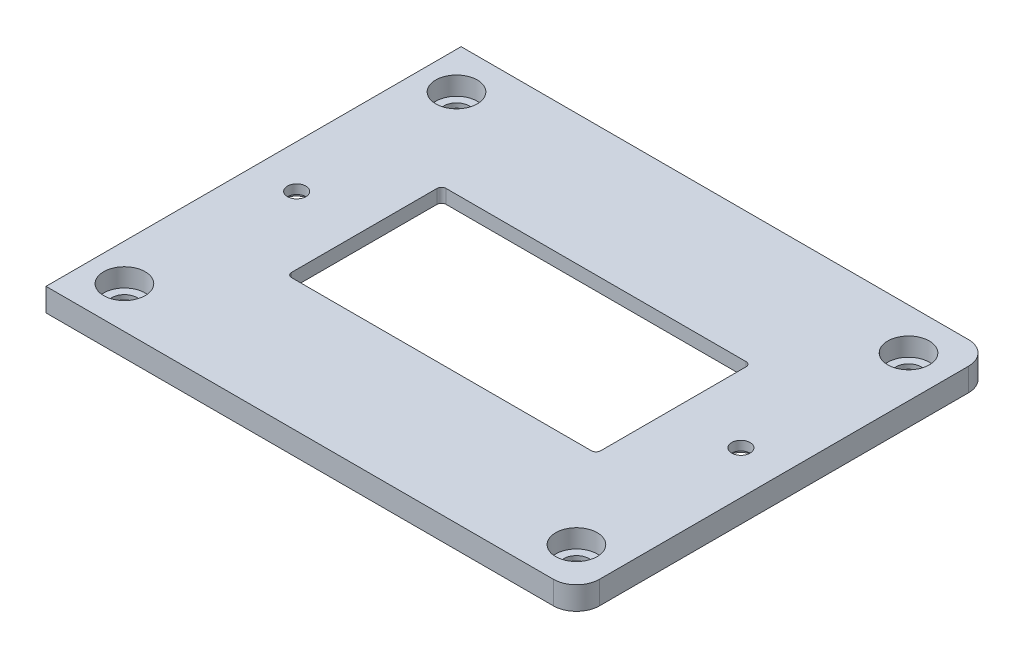
ISO-10303-21;
HEADER;
FILE_DESCRIPTION(('STEP AP214'),'2;1');
FILE_NAME('part.step','',(''),(''),'','','');
FILE_SCHEMA(('AUTOMOTIVE_DESIGN { 1 0 10303 214 1 1 1 1 }'));
ENDSEC;
DATA;
#1=APPLICATION_CONTEXT('core data for automotive mechanical design processes');
#2=APPLICATION_PROTOCOL_DEFINITION('international standard','automotive_design',2000,#1);
#3=PRODUCT_CONTEXT('',#1,'mechanical');
#4=PRODUCT('Part','Part','',(#3));
#5=PRODUCT_RELATED_PRODUCT_CATEGORY('part','',(#4));
#6=PRODUCT_DEFINITION_FORMATION('','',#4);
#7=PRODUCT_DEFINITION_CONTEXT('part definition',#1,'design');
#8=PRODUCT_DEFINITION('design','',#6,#7);
#9=PRODUCT_DEFINITION_SHAPE('','',#8);
#10=(LENGTH_UNIT() NAMED_UNIT(*) SI_UNIT(.MILLI.,.METRE.));
#11=(NAMED_UNIT(*) PLANE_ANGLE_UNIT() SI_UNIT($,.RADIAN.));
#12=(NAMED_UNIT(*) SI_UNIT($,.STERADIAN.) SOLID_ANGLE_UNIT());
#13=UNCERTAINTY_MEASURE_WITH_UNIT(LENGTH_MEASURE(1.E-05),#10,'distance_accuracy_value','');
#14=(GEOMETRIC_REPRESENTATION_CONTEXT(3) GLOBAL_UNCERTAINTY_ASSIGNED_CONTEXT((#13)) GLOBAL_UNIT_ASSIGNED_CONTEXT((#10,
#11,#12)) REPRESENTATION_CONTEXT('',''));
#15=CARTESIAN_POINT('',(0.,0.,0.));
#16=DIRECTION('',(0.,0.,1.));
#17=DIRECTION('',(1.,0.,0.));
#18=AXIS2_PLACEMENT_3D('',#15,#16,#17);
#19=CARTESIAN_POINT('',(0.,5.,0.));
#20=DIRECTION('',(0.,1.,0.));
#21=DIRECTION('',(0.,0.,1.));
#22=AXIS2_PLACEMENT_3D('',#19,#20,#21);
#23=PLANE('',#22);
#24=CARTESIAN_POINT('',(-48.15,5.,0.));
#25=DIRECTION('',(0.,-1.,0.));
#26=DIRECTION('',(0.,0.,-1.));
#27=AXIS2_PLACEMENT_3D('',#24,#25,#26);
#28=CIRCLE('',#27,2.);
#29=CARTESIAN_POINT('',(-48.15,5.,-1.99999999999999));
#30=VERTEX_POINT('',#29);
#31=EDGE_CURVE('E544',#30,#30,#28,.T.);
#32=ORIENTED_EDGE('',*,*,#31,.T.);
#33=EDGE_LOOP('',(#32));
#34=FACE_BOUND('',#33,.T.);
#35=DIRECTION('',(1.,0.,0.));
#36=VECTOR('',#35,1.);
#37=CARTESIAN_POINT('',(0.,5.,45.));
#38=LINE('',#37,#36);
#39=CARTESIAN_POINT('',(-57.5,5.,45.));
#40=VERTEX_POINT('',#39);
#41=CARTESIAN_POINT('',(52.5,5.,45.));
#42=VERTEX_POINT('',#41);
#43=EDGE_CURVE('E300',#40,#42,#38,.T.);
#44=ORIENTED_EDGE('',*,*,#43,.T.);
#45=CARTESIAN_POINT('',(52.5,5.,40.));
#46=DIRECTION('',(0.,1.,0.));
#47=DIRECTION('',(0.,0.,1.));
#48=AXIS2_PLACEMENT_3D('',#45,#46,#47);
#49=CIRCLE('',#48,5.);
#50=CARTESIAN_POINT('',(57.5,5.,40.));
#51=VERTEX_POINT('',#50);
#52=EDGE_CURVE('E355',#42,#51,#49,.T.);
#53=ORIENTED_EDGE('',*,*,#52,.T.);
#54=DIRECTION('',(0.,0.,-1.));
#55=VECTOR('',#54,1.);
#56=CARTESIAN_POINT('',(57.5,5.,0.));
#57=LINE('',#56,#55);
#58=CARTESIAN_POINT('',(57.5,5.,-40.));
#59=VERTEX_POINT('',#58);
#60=EDGE_CURVE('E304',#51,#59,#57,.T.);
#61=ORIENTED_EDGE('',*,*,#60,.T.);
#62=CARTESIAN_POINT('',(52.5,5.,-40.));
#63=DIRECTION('',(0.,1.,0.));
#64=DIRECTION('',(0.,0.,1.));
#65=AXIS2_PLACEMENT_3D('',#62,#63,#64);
#66=CIRCLE('',#65,5.);
#67=CARTESIAN_POINT('',(52.5,5.,-45.));
#68=VERTEX_POINT('',#67);
#69=EDGE_CURVE('E352',#59,#68,#66,.T.);
#70=ORIENTED_EDGE('',*,*,#69,.T.);
#71=DIRECTION('',(1.,0.,0.));
#72=VECTOR('',#71,1.);
#73=CARTESIAN_POINT('',(0.,5.,-45.));
#74=LINE('',#73,#72);
#75=CARTESIAN_POINT('',(-57.5,5.,-45.));
#76=VERTEX_POINT('',#75);
#77=EDGE_CURVE('E308',#76,#68,#74,.T.);
#78=ORIENTED_EDGE('',*,*,#77,.F.);
#79=DIRECTION('',(0.,0.,-1.));
#80=VECTOR('',#79,1.);
#81=CARTESIAN_POINT('',(-57.5,5.,0.));
#82=LINE('',#81,#80);
#83=EDGE_CURVE('E312',#40,#76,#82,.T.);
#84=ORIENTED_EDGE('',*,*,#83,.F.);
#85=EDGE_LOOP('',(#44,#53,#61,#70,#78,#84));
#86=FACE_BOUND('',#85,.T.);
#87=DIRECTION('',(1.,0.,0.));
#88=VECTOR('',#87,1.);
#89=CARTESIAN_POINT('',(0.,5.,16.75));
#90=LINE('',#89,#88);
#91=CARTESIAN_POINT('',(-32.5,5.,16.75));
#92=VERTEX_POINT('',#91);
#93=CARTESIAN_POINT('',(32.5,5.,16.75));
#94=VERTEX_POINT('',#93);
#95=EDGE_CURVE('E296',#92,#94,#90,.T.);
#96=ORIENTED_EDGE('',*,*,#95,.F.);
#97=CARTESIAN_POINT('',(-32.5,5.,15.75));
#98=DIRECTION('',(0.,1.,0.));
#99=DIRECTION('',(0.,0.,1.));
#100=AXIS2_PLACEMENT_3D('',#97,#98,#99);
#101=CIRCLE('',#100,1.);
#102=CARTESIAN_POINT('',(-33.5,5.,15.75));
#103=VERTEX_POINT('',#102);
#104=EDGE_CURVE('E390',#92,#103,#101,.F.);
#105=ORIENTED_EDGE('',*,*,#104,.T.);
#106=DIRECTION('',(0.,0.,-1.));
#107=VECTOR('',#106,1.);
#108=CARTESIAN_POINT('',(-33.5,5.,0.));
#109=LINE('',#108,#107);
#110=CARTESIAN_POINT('',(-33.5,5.,-15.75));
#111=VERTEX_POINT('',#110);
#112=EDGE_CURVE('E283',#103,#111,#109,.T.);
#113=ORIENTED_EDGE('',*,*,#112,.T.);
#114=CARTESIAN_POINT('',(-32.5,5.,-15.75));
#115=DIRECTION('',(0.,1.,0.));
#116=DIRECTION('',(0.,0.,1.));
#117=AXIS2_PLACEMENT_3D('',#114,#115,#116);
#118=CIRCLE('',#117,1.);
#119=CARTESIAN_POINT('',(-32.5,5.,-16.75));
#120=VERTEX_POINT('',#119);
#121=EDGE_CURVE('E396',#111,#120,#118,.F.);
#122=ORIENTED_EDGE('',*,*,#121,.T.);
#123=DIRECTION('',(1.,0.,0.));
#124=VECTOR('',#123,1.);
#125=CARTESIAN_POINT('',(0.,5.,-16.75));
#126=LINE('',#125,#124);
#127=CARTESIAN_POINT('',(32.5,5.,-16.75));
#128=VERTEX_POINT('',#127);
#129=EDGE_CURVE('E287',#120,#128,#126,.T.);
#130=ORIENTED_EDGE('',*,*,#129,.T.);
#131=CARTESIAN_POINT('',(32.5,5.,-15.75));
#132=DIRECTION('',(0.,1.,0.));
#133=DIRECTION('',(0.,0.,1.));
#134=AXIS2_PLACEMENT_3D('',#131,#132,#133);
#135=CIRCLE('',#134,1.);
#136=CARTESIAN_POINT('',(33.5,5.,-15.75));
#137=VERTEX_POINT('',#136);
#138=EDGE_CURVE('E47',#128,#137,#135,.F.);
#139=ORIENTED_EDGE('',*,*,#138,.T.);
#140=DIRECTION('',(0.,0.,-1.));
#141=VECTOR('',#140,1.);
#142=CARTESIAN_POINT('',(33.5,5.,0.));
#143=LINE('',#142,#141);
#144=CARTESIAN_POINT('',(33.5,5.,15.75));
#145=VERTEX_POINT('',#144);
#146=EDGE_CURVE('E292',#145,#137,#143,.T.);
#147=ORIENTED_EDGE('',*,*,#146,.F.);
#148=CARTESIAN_POINT('',(32.5,5.,15.75));
#149=DIRECTION('',(0.,1.,0.));
#150=DIRECTION('',(0.,0.,1.));
#151=AXIS2_PLACEMENT_3D('',#148,#149,#150);
#152=CIRCLE('',#151,1.);
#153=EDGE_CURVE('E393',#145,#94,#152,.F.);
#154=ORIENTED_EDGE('',*,*,#153,.T.);
#155=EDGE_LOOP('',(#96,#105,#113,#122,#130,#139,#147,#154));
#156=FACE_BOUND('',#155,.T.);
#157=CARTESIAN_POINT('',(48.5,5.,-36.));
#158=DIRECTION('',(0.,1.,0.));
#159=DIRECTION('',(0.,0.,1.));
#160=AXIS2_PLACEMENT_3D('',#157,#158,#159);
#161=CIRCLE('',#160,4.5);
#162=CARTESIAN_POINT('',(48.5,5.,-31.5));
#163=VERTEX_POINT('',#162);
#164=EDGE_CURVE('E266',#163,#163,#161,.T.);
#165=ORIENTED_EDGE('',*,*,#164,.F.);
#166=EDGE_LOOP('',(#165));
#167=FACE_BOUND('',#166,.T.);
#168=CARTESIAN_POINT('',(48.5,5.,36.));
#169=DIRECTION('',(0.,1.,0.));
#170=DIRECTION('',(0.,0.,1.));
#171=AXIS2_PLACEMENT_3D('',#168,#169,#170);
#172=CIRCLE('',#171,4.5);
#173=CARTESIAN_POINT('',(48.5,5.,40.5));
#174=VERTEX_POINT('',#173);
#175=EDGE_CURVE('E250',#174,#174,#172,.T.);
#176=ORIENTED_EDGE('',*,*,#175,.F.);
#177=EDGE_LOOP('',(#176));
#178=FACE_BOUND('',#177,.T.);
#179=CARTESIAN_POINT('',(-49.5,5.,36.));
#180=DIRECTION('',(0.,1.,0.));
#181=DIRECTION('',(0.,0.,1.));
#182=AXIS2_PLACEMENT_3D('',#179,#180,#181);
#183=CIRCLE('',#182,4.5);
#184=CARTESIAN_POINT('',(-49.5,5.,40.5));
#185=VERTEX_POINT('',#184);
#186=EDGE_CURVE('E234',#185,#185,#183,.T.);
#187=ORIENTED_EDGE('',*,*,#186,.F.);
#188=EDGE_LOOP('',(#187));
#189=FACE_BOUND('',#188,.T.);
#190=CARTESIAN_POINT('',(-49.5,5.,-36.));
#191=DIRECTION('',(0.,1.,0.));
#192=DIRECTION('',(0.,0.,1.));
#193=AXIS2_PLACEMENT_3D('',#190,#191,#192);
#194=CIRCLE('',#193,4.5);
#195=CARTESIAN_POINT('',(-49.5,5.,-31.5));
#196=VERTEX_POINT('',#195);
#197=EDGE_CURVE('E218',#196,#196,#194,.T.);
#198=ORIENTED_EDGE('',*,*,#197,.F.);
#199=EDGE_LOOP('',(#198));
#200=FACE_BOUND('',#199,.T.);
#201=CARTESIAN_POINT('',(48.15,5.,0.));
#202=DIRECTION('',(0.,-1.,0.));
#203=DIRECTION('',(0.,0.,-1.));
#204=AXIS2_PLACEMENT_3D('',#201,#202,#203);
#205=CIRCLE('',#204,2.);
#206=CARTESIAN_POINT('',(48.15,5.,-1.99999999999999));
#207=VERTEX_POINT('',#206);
#208=EDGE_CURVE('E525',#207,#207,#205,.T.);
#209=ORIENTED_EDGE('',*,*,#208,.T.);
#210=EDGE_LOOP('',(#209));
#211=FACE_BOUND('',#210,.T.);
#212=ADVANCED_FACE('F38',(#34,#86,#156,#167,#178,#189,#200,#211),#23,.T.);
#213=CARTESIAN_POINT('',(-33.5,5.,0.));
#214=DIRECTION('',(-1.,0.,0.));
#215=DIRECTION('',(0.,0.,1.));
#216=AXIS2_PLACEMENT_3D('',#213,#214,#215);
#217=PLANE('',#216);
#218=DIRECTION('',(0.,0.,1.));
#219=VECTOR('',#218,1.);
#220=CARTESIAN_POINT('',(-33.5,2.,0.));
#221=LINE('',#220,#219);
#222=CARTESIAN_POINT('',(-33.5,2.,-15.75));
#223=VERTEX_POINT('',#222);
#224=CARTESIAN_POINT('',(-33.5,2.,15.75));
#225=VERTEX_POINT('',#224);
#226=EDGE_CURVE('E212',#223,#225,#221,.T.);
#227=ORIENTED_EDGE('',*,*,#226,.F.);
#228=DIRECTION('',(0.,-1.,0.));
#229=VECTOR('',#228,1.);
#230=CARTESIAN_POINT('',(-33.5,5.,-15.75));
#231=LINE('',#230,#229);
#232=EDGE_CURVE('E362',#223,#111,#231,.F.);
#233=ORIENTED_EDGE('',*,*,#232,.T.);
#234=ORIENTED_EDGE('',*,*,#112,.F.);
#235=DIRECTION('',(0.,-1.,0.));
#236=VECTOR('',#235,1.);
#237=CARTESIAN_POINT('',(-33.5,5.,15.75));
#238=LINE('',#237,#236);
#239=EDGE_CURVE('E365',#103,#225,#238,.T.);
#240=ORIENTED_EDGE('',*,*,#239,.T.);
#241=EDGE_LOOP('',(#227,#233,#234,#240));
#242=FACE_BOUND('',#241,.T.);
#243=ADVANCED_FACE('F424',(#242),#217,.F.);
#244=CARTESIAN_POINT('',(0.,5.,-16.75));
#245=DIRECTION('',(0.,0.,-1.));
#246=DIRECTION('',(-1.,0.,0.));
#247=AXIS2_PLACEMENT_3D('',#244,#245,#246);
#248=PLANE('',#247);
#249=DIRECTION('',(-1.,0.,0.));
#250=VECTOR('',#249,1.);
#251=CARTESIAN_POINT('',(0.,2.,-16.75));
#252=LINE('',#251,#250);
#253=CARTESIAN_POINT('',(32.5,2.,-16.75));
#254=VERTEX_POINT('',#253);
#255=CARTESIAN_POINT('',(-32.5,2.,-16.75));
#256=VERTEX_POINT('',#255);
#257=EDGE_CURVE('E198',#254,#256,#252,.T.);
#258=ORIENTED_EDGE('',*,*,#257,.F.);
#259=DIRECTION('',(0.,-1.,0.));
#260=VECTOR('',#259,1.);
#261=CARTESIAN_POINT('',(32.5,5.,-16.75));
#262=LINE('',#261,#260);
#263=EDGE_CURVE('E383',#254,#128,#262,.F.);
#264=ORIENTED_EDGE('',*,*,#263,.T.);
#265=ORIENTED_EDGE('',*,*,#129,.F.);
#266=DIRECTION('',(0.,-1.,0.));
#267=VECTOR('',#266,1.);
#268=CARTESIAN_POINT('',(-32.5,0.,-16.75));
#269=LINE('',#268,#267);
#270=EDGE_CURVE('E386',#120,#256,#269,.T.);
#271=ORIENTED_EDGE('',*,*,#270,.T.);
#272=EDGE_LOOP('',(#258,#264,#265,#271));
#273=FACE_BOUND('',#272,.T.);
#274=ADVANCED_FACE('F415',(#273),#248,.F.);
#275=CARTESIAN_POINT('',(33.5,5.,0.));
#276=DIRECTION('',(-1.,0.,0.));
#277=DIRECTION('',(0.,0.,1.));
#278=AXIS2_PLACEMENT_3D('',#275,#276,#277);
#279=PLANE('',#278);
#280=DIRECTION('',(0.,-1.,0.));
#281=VECTOR('',#280,1.);
#282=CARTESIAN_POINT('',(33.5,5.,-15.75));
#283=LINE('',#282,#281);
#284=CARTESIAN_POINT('',(33.5,2.,-15.75));
#285=VERTEX_POINT('',#284);
#286=EDGE_CURVE('E376',#137,#285,#283,.T.);
#287=ORIENTED_EDGE('',*,*,#286,.T.);
#288=DIRECTION('',(0.,0.,1.));
#289=VECTOR('',#288,1.);
#290=CARTESIAN_POINT('',(33.5,2.,0.));
#291=LINE('',#290,#289);
#292=CARTESIAN_POINT('',(33.5,2.,15.75));
#293=VERTEX_POINT('',#292);
#294=EDGE_CURVE('E61',#285,#293,#291,.T.);
#295=ORIENTED_EDGE('',*,*,#294,.T.);
#296=DIRECTION('',(0.,-1.,0.));
#297=VECTOR('',#296,1.);
#298=CARTESIAN_POINT('',(33.5,5.,15.75));
#299=LINE('',#298,#297);
#300=EDGE_CURVE('E380',#293,#145,#299,.F.);
#301=ORIENTED_EDGE('',*,*,#300,.T.);
#302=ORIENTED_EDGE('',*,*,#146,.T.);
#303=EDGE_LOOP('',(#287,#295,#301,#302));
#304=FACE_BOUND('',#303,.T.);
#305=ADVANCED_FACE('F410',(#304),#279,.T.);
#306=CARTESIAN_POINT('',(0.,5.,16.75));
#307=DIRECTION('',(0.,0.,-1.));
#308=DIRECTION('',(-1.,0.,0.));
#309=AXIS2_PLACEMENT_3D('',#306,#307,#308);
#310=PLANE('',#309);
#311=DIRECTION('',(0.,-1.,0.));
#312=VECTOR('',#311,1.);
#313=CARTESIAN_POINT('',(32.5,0.,16.75));
#314=LINE('',#313,#312);
#315=CARTESIAN_POINT('',(32.5,2.,16.75));
#316=VERTEX_POINT('',#315);
#317=EDGE_CURVE('E369',#94,#316,#314,.T.);
#318=ORIENTED_EDGE('',*,*,#317,.T.);
#319=DIRECTION('',(-1.,0.,0.));
#320=VECTOR('',#319,1.);
#321=CARTESIAN_POINT('',(0.,2.,16.75));
#322=LINE('',#321,#320);
#323=CARTESIAN_POINT('',(-32.5,2.,16.75));
#324=VERTEX_POINT('',#323);
#325=EDGE_CURVE('E208',#316,#324,#322,.T.);
#326=ORIENTED_EDGE('',*,*,#325,.T.);
#327=DIRECTION('',(0.,-1.,0.));
#328=VECTOR('',#327,1.);
#329=CARTESIAN_POINT('',(-32.5,5.,16.75));
#330=LINE('',#329,#328);
#331=EDGE_CURVE('E373',#324,#92,#330,.F.);
#332=ORIENTED_EDGE('',*,*,#331,.T.);
#333=ORIENTED_EDGE('',*,*,#95,.T.);
#334=EDGE_LOOP('',(#318,#326,#332,#333));
#335=FACE_BOUND('',#334,.T.);
#336=ADVANCED_FACE('F433',(#335),#310,.T.);
#337=CARTESIAN_POINT('',(-32.5,5.,15.75));
#338=DIRECTION('',(0.,-1.,0.));
#339=DIRECTION('',(0.,0.,-1.));
#340=AXIS2_PLACEMENT_3D('',#337,#338,#339);
#341=CYLINDRICAL_SURFACE('',#340,1.);
#342=CARTESIAN_POINT('',(-32.5,2.,15.75));
#343=DIRECTION('',(0.,-1.,0.));
#344=DIRECTION('',(0.,0.,-1.));
#345=AXIS2_PLACEMENT_3D('',#342,#343,#344);
#346=CIRCLE('',#345,1.);
#347=EDGE_CURVE('E215',#225,#324,#346,.F.);
#348=ORIENTED_EDGE('',*,*,#347,.F.);
#349=ORIENTED_EDGE('',*,*,#239,.F.);
#350=ORIENTED_EDGE('',*,*,#104,.F.);
#351=ORIENTED_EDGE('',*,*,#331,.F.);
#352=EDGE_LOOP('',(#348,#349,#350,#351));
#353=FACE_BOUND('',#352,.T.);
#354=ADVANCED_FACE('F429',(#353),#341,.F.);
#355=CARTESIAN_POINT('',(32.5,5.,15.75));
#356=DIRECTION('',(0.,1.,0.));
#357=DIRECTION('',(0.,0.,1.));
#358=AXIS2_PLACEMENT_3D('',#355,#356,#357);
#359=CYLINDRICAL_SURFACE('',#358,1.);
#360=CARTESIAN_POINT('',(32.5,2.,15.75));
#361=DIRECTION('',(0.,-1.,0.));
#362=DIRECTION('',(0.,0.,-1.));
#363=AXIS2_PLACEMENT_3D('',#360,#361,#362);
#364=CIRCLE('',#363,1.);
#365=EDGE_CURVE('E205',#316,#293,#364,.F.);
#366=ORIENTED_EDGE('',*,*,#365,.F.);
#367=ORIENTED_EDGE('',*,*,#317,.F.);
#368=ORIENTED_EDGE('',*,*,#153,.F.);
#369=ORIENTED_EDGE('',*,*,#300,.F.);
#370=EDGE_LOOP('',(#366,#367,#368,#369));
#371=FACE_BOUND('',#370,.T.);
#372=ADVANCED_FACE('F436',(#371),#359,.F.);
#373=CARTESIAN_POINT('',(-32.5,5.,-15.75));
#374=DIRECTION('',(0.,1.,0.));
#375=DIRECTION('',(0.,0.,1.));
#376=AXIS2_PLACEMENT_3D('',#373,#374,#375);
#377=CYLINDRICAL_SURFACE('',#376,1.);
#378=CARTESIAN_POINT('',(-32.5,2.,-15.75));
#379=DIRECTION('',(0.,-1.,0.));
#380=DIRECTION('',(0.,0.,-1.));
#381=AXIS2_PLACEMENT_3D('',#378,#379,#380);
#382=CIRCLE('',#381,1.);
#383=EDGE_CURVE('E202',#256,#223,#382,.F.);
#384=ORIENTED_EDGE('',*,*,#383,.F.);
#385=ORIENTED_EDGE('',*,*,#270,.F.);
#386=ORIENTED_EDGE('',*,*,#121,.F.);
#387=ORIENTED_EDGE('',*,*,#232,.F.);
#388=EDGE_LOOP('',(#384,#385,#386,#387));
#389=FACE_BOUND('',#388,.T.);
#390=ADVANCED_FACE('F419',(#389),#377,.F.);
#391=CARTESIAN_POINT('',(32.5,5.,-15.75));
#392=DIRECTION('',(0.,-1.,0.));
#393=DIRECTION('',(0.,0.,-1.));
#394=AXIS2_PLACEMENT_3D('',#391,#392,#393);
#395=CYLINDRICAL_SURFACE('',#394,1.);
#396=CARTESIAN_POINT('',(32.5,2.,-15.75));
#397=DIRECTION('',(0.,-1.,0.));
#398=DIRECTION('',(0.,0.,-1.));
#399=AXIS2_PLACEMENT_3D('',#396,#397,#398);
#400=CIRCLE('',#399,1.);
#401=EDGE_CURVE('E11',#285,#254,#400,.F.);
#402=ORIENTED_EDGE('',*,*,#401,.F.);
#403=ORIENTED_EDGE('',*,*,#286,.F.);
#404=ORIENTED_EDGE('',*,*,#138,.F.);
#405=ORIENTED_EDGE('',*,*,#263,.F.);
#406=EDGE_LOOP('',(#402,#403,#404,#405));
#407=FACE_BOUND('',#406,.T.);
#408=ADVANCED_FACE('F40',(#407),#395,.F.);
#409=CARTESIAN_POINT('',(0.,5.,45.));
#410=DIRECTION('',(0.,0.,-1.));
#411=DIRECTION('',(-1.,0.,0.));
#412=AXIS2_PLACEMENT_3D('',#409,#410,#411);
#413=PLANE('',#412);
#414=DIRECTION('',(1.,0.,0.));
#415=VECTOR('',#414,1.);
#416=CARTESIAN_POINT('',(0.,0.,45.));
#417=LINE('',#416,#415);
#418=CARTESIAN_POINT('',(-57.5,0.,45.));
#419=VERTEX_POINT('',#418);
#420=CARTESIAN_POINT('',(52.5,0.,45.));
#421=VERTEX_POINT('',#420);
#422=EDGE_CURVE('E282',#419,#421,#417,.T.);
#423=ORIENTED_EDGE('',*,*,#422,.T.);
#424=DIRECTION('',(0.,-1.,0.));
#425=VECTOR('',#424,1.);
#426=CARTESIAN_POINT('',(52.5,5.,45.));
#427=LINE('',#426,#425);
#428=EDGE_CURVE('E349',#421,#42,#427,.F.);
#429=ORIENTED_EDGE('',*,*,#428,.T.);
#430=ORIENTED_EDGE('',*,*,#43,.F.);
#431=DIRECTION('',(0.,-1.,0.));
#432=VECTOR('',#431,1.);
#433=CARTESIAN_POINT('',(-57.5,5.,45.));
#434=LINE('',#433,#432);
#435=EDGE_CURVE('E316',#40,#419,#434,.T.);
#436=ORIENTED_EDGE('',*,*,#435,.T.);
#437=EDGE_LOOP('',(#423,#429,#430,#436));
#438=FACE_BOUND('',#437,.T.);
#439=ADVANCED_FACE('F473',(#438),#413,.F.);
#440=CARTESIAN_POINT('',(57.5,5.,0.));
#441=DIRECTION('',(-1.,0.,0.));
#442=DIRECTION('',(0.,0.,1.));
#443=AXIS2_PLACEMENT_3D('',#440,#441,#442);
#444=PLANE('',#443);
#445=ORIENTED_EDGE('',*,*,#60,.F.);
#446=DIRECTION('',(0.,-1.,0.));
#447=VECTOR('',#446,1.);
#448=CARTESIAN_POINT('',(57.5,5.,40.));
#449=LINE('',#448,#447);
#450=CARTESIAN_POINT('',(57.5,0.,40.));
#451=VERTEX_POINT('',#450);
#452=EDGE_CURVE('E339',#51,#451,#449,.T.);
#453=ORIENTED_EDGE('',*,*,#452,.T.);
#454=DIRECTION('',(0.,0.,-1.));
#455=VECTOR('',#454,1.);
#456=CARTESIAN_POINT('',(57.5,0.,0.));
#457=LINE('',#456,#455);
#458=CARTESIAN_POINT('',(57.5,0.,-40.));
#459=VERTEX_POINT('',#458);
#460=EDGE_CURVE('E320',#451,#459,#457,.T.);
#461=ORIENTED_EDGE('',*,*,#460,.T.);
#462=DIRECTION('',(0.,-1.,0.));
#463=VECTOR('',#462,1.);
#464=CARTESIAN_POINT('',(57.5,5.,-40.));
#465=LINE('',#464,#463);
#466=EDGE_CURVE('E336',#459,#59,#465,.F.);
#467=ORIENTED_EDGE('',*,*,#466,.T.);
#468=EDGE_LOOP('',(#445,#453,#461,#467));
#469=FACE_BOUND('',#468,.T.);
#470=ADVANCED_FACE('F469',(#469),#444,.F.);
#471=CARTESIAN_POINT('',(0.,5.,-45.));
#472=DIRECTION('',(0.,0.,-1.));
#473=DIRECTION('',(-1.,0.,0.));
#474=AXIS2_PLACEMENT_3D('',#471,#472,#473);
#475=PLANE('',#474);
#476=ORIENTED_EDGE('',*,*,#77,.T.);
#477=DIRECTION('',(0.,-1.,0.));
#478=VECTOR('',#477,1.);
#479=CARTESIAN_POINT('',(52.5,0.,-45.));
#480=LINE('',#479,#478);
#481=CARTESIAN_POINT('',(52.5,0.,-45.));
#482=VERTEX_POINT('',#481);
#483=EDGE_CURVE('E358',#68,#482,#480,.T.);
#484=ORIENTED_EDGE('',*,*,#483,.T.);
#485=DIRECTION('',(1.,0.,0.));
#486=VECTOR('',#485,1.);
#487=CARTESIAN_POINT('',(0.,0.,-45.));
#488=LINE('',#487,#486);
#489=CARTESIAN_POINT('',(-57.5,0.,-45.));
#490=VERTEX_POINT('',#489);
#491=EDGE_CURVE('E324',#490,#482,#488,.T.);
#492=ORIENTED_EDGE('',*,*,#491,.F.);
#493=DIRECTION('',(0.,-1.,0.));
#494=VECTOR('',#493,1.);
#495=CARTESIAN_POINT('',(-57.5,5.,-45.));
#496=LINE('',#495,#494);
#497=EDGE_CURVE('E333',#76,#490,#496,.T.);
#498=ORIENTED_EDGE('',*,*,#497,.F.);
#499=EDGE_LOOP('',(#476,#484,#492,#498));
#500=FACE_BOUND('',#499,.T.);
#501=ADVANCED_FACE('F466',(#500),#475,.T.);
#502=CARTESIAN_POINT('',(-57.5,5.,0.));
#503=DIRECTION('',(-1.,0.,0.));
#504=DIRECTION('',(0.,0.,1.));
#505=AXIS2_PLACEMENT_3D('',#502,#503,#504);
#506=PLANE('',#505);
#507=DIRECTION('',(0.,-1.,0.));
#508=VECTOR('',#507,1.);
#509=CARTESIAN_POINT('',(-57.5,2.,30.));
#510=LINE('',#509,#508);
#511=CARTESIAN_POINT('',(-57.5,2.,30.));
#512=VERTEX_POINT('',#511);
#513=CARTESIAN_POINT('',(-57.5,0.,30.));
#514=VERTEX_POINT('',#513);
#515=EDGE_CURVE('E199',#512,#514,#510,.T.);
#516=ORIENTED_EDGE('',*,*,#515,.T.);
#517=DIRECTION('',(0.,0.,-1.));
#518=VECTOR('',#517,1.);
#519=CARTESIAN_POINT('',(-57.5,0.,0.));
#520=LINE('',#519,#518);
#521=EDGE_CURVE('E288',#419,#514,#520,.T.);
#522=ORIENTED_EDGE('',*,*,#521,.F.);
#523=ORIENTED_EDGE('',*,*,#435,.F.);
#524=ORIENTED_EDGE('',*,*,#83,.T.);
#525=ORIENTED_EDGE('',*,*,#497,.T.);
#526=CARTESIAN_POINT('',(-57.5,0.,-30.));
#527=VERTEX_POINT('',#526);
#528=EDGE_CURVE('E186',#527,#490,#520,.T.);
#529=ORIENTED_EDGE('',*,*,#528,.F.);
#530=DIRECTION('',(0.,-1.,0.));
#531=VECTOR('',#530,1.);
#532=CARTESIAN_POINT('',(-57.5,2.,-30.));
#533=LINE('',#532,#531);
#534=CARTESIAN_POINT('',(-57.5,2.,-30.));
#535=VERTEX_POINT('',#534);
#536=EDGE_CURVE('E54',#535,#527,#533,.T.);
#537=ORIENTED_EDGE('',*,*,#536,.F.);
#538=DIRECTION('',(0.,0.,-1.));
#539=VECTOR('',#538,1.);
#540=CARTESIAN_POINT('',(-57.5,2.,30.));
#541=LINE('',#540,#539);
#542=EDGE_CURVE('E171',#512,#535,#541,.T.);
#543=ORIENTED_EDGE('',*,*,#542,.F.);
#544=EDGE_LOOP('',(#516,#522,#523,#524,#525,#529,#537,#543));
#545=FACE_BOUND('',#544,.T.);
#546=ADVANCED_FACE('F184',(#545),#506,.T.);
#547=CARTESIAN_POINT('',(0.,0.,0.));
#548=DIRECTION('',(0.,1.,0.));
#549=DIRECTION('',(0.,0.,1.));
#550=AXIS2_PLACEMENT_3D('',#547,#548,#549);
#551=PLANE('',#550);
#552=CARTESIAN_POINT('',(-49.5,0.,-36.));
#553=DIRECTION('',(0.,1.,0.));
#554=DIRECTION('',(0.,0.,1.));
#555=AXIS2_PLACEMENT_3D('',#552,#553,#554);
#556=CIRCLE('',#555,2.75);
#557=CARTESIAN_POINT('',(-49.5,0.,-33.25));
#558=VERTEX_POINT('',#557);
#559=EDGE_CURVE('E230',#558,#558,#556,.T.);
#560=ORIENTED_EDGE('',*,*,#559,.T.);
#561=EDGE_LOOP('',(#560));
#562=FACE_BOUND('',#561,.T.);
#563=CARTESIAN_POINT('',(-49.5,0.,36.));
#564=DIRECTION('',(0.,1.,0.));
#565=DIRECTION('',(0.,0.,1.));
#566=AXIS2_PLACEMENT_3D('',#563,#564,#565);
#567=CIRCLE('',#566,2.75);
#568=CARTESIAN_POINT('',(-49.5,0.,38.75));
#569=VERTEX_POINT('',#568);
#570=EDGE_CURVE('E246',#569,#569,#567,.T.);
#571=ORIENTED_EDGE('',*,*,#570,.T.);
#572=EDGE_LOOP('',(#571));
#573=FACE_BOUND('',#572,.T.);
#574=CARTESIAN_POINT('',(48.5,0.,36.));
#575=DIRECTION('',(0.,1.,0.));
#576=DIRECTION('',(0.,0.,1.));
#577=AXIS2_PLACEMENT_3D('',#574,#575,#576);
#578=CIRCLE('',#577,2.75);
#579=CARTESIAN_POINT('',(48.5,0.,38.75));
#580=VERTEX_POINT('',#579);
#581=EDGE_CURVE('E262',#580,#580,#578,.T.);
#582=ORIENTED_EDGE('',*,*,#581,.T.);
#583=EDGE_LOOP('',(#582));
#584=FACE_BOUND('',#583,.T.);
#585=CARTESIAN_POINT('',(48.5,0.,-36.));
#586=DIRECTION('',(0.,1.,0.));
#587=DIRECTION('',(0.,0.,1.));
#588=AXIS2_PLACEMENT_3D('',#585,#586,#587);
#589=CIRCLE('',#588,2.75);
#590=CARTESIAN_POINT('',(48.5,0.,-33.25));
#591=VERTEX_POINT('',#590);
#592=EDGE_CURVE('E278',#591,#591,#589,.T.);
#593=ORIENTED_EDGE('',*,*,#592,.T.);
#594=EDGE_LOOP('',(#593));
#595=FACE_BOUND('',#594,.T.);
#596=ORIENTED_EDGE('',*,*,#521,.T.);
#597=DIRECTION('',(-1.,0.,0.));
#598=VECTOR('',#597,1.);
#599=CARTESIAN_POINT('',(-57.5,0.,30.));
#600=LINE('',#599,#598);
#601=CARTESIAN_POINT('',(53.5,0.,30.));
#602=VERTEX_POINT('',#601);
#603=EDGE_CURVE('E181',#602,#514,#600,.T.);
#604=ORIENTED_EDGE('',*,*,#603,.F.);
#605=DIRECTION('',(0.,0.,1.));
#606=VECTOR('',#605,1.);
#607=CARTESIAN_POINT('',(53.5,0.,30.));
#608=LINE('',#607,#606);
#609=CARTESIAN_POINT('',(53.5000000000001,0.,-30.));
#610=VERTEX_POINT('',#609);
#611=EDGE_CURVE('E521',#610,#602,#608,.T.);
#612=ORIENTED_EDGE('',*,*,#611,.F.);
#613=DIRECTION('',(1.,0.,0.));
#614=VECTOR('',#613,1.);
#615=CARTESIAN_POINT('',(-57.5,0.,-30.));
#616=LINE('',#615,#614);
#617=EDGE_CURVE('E511',#527,#610,#616,.T.);
#618=ORIENTED_EDGE('',*,*,#617,.F.);
#619=ORIENTED_EDGE('',*,*,#528,.T.);
#620=ORIENTED_EDGE('',*,*,#491,.T.);
#621=CARTESIAN_POINT('',(52.5,0.,-40.));
#622=DIRECTION('',(0.,1.,0.));
#623=DIRECTION('',(0.,0.,1.));
#624=AXIS2_PLACEMENT_3D('',#621,#622,#623);
#625=CIRCLE('',#624,5.);
#626=EDGE_CURVE('E343',#482,#459,#625,.F.);
#627=ORIENTED_EDGE('',*,*,#626,.T.);
#628=ORIENTED_EDGE('',*,*,#460,.F.);
#629=CARTESIAN_POINT('',(52.5,0.,40.));
#630=DIRECTION('',(0.,1.,0.));
#631=DIRECTION('',(0.,0.,1.));
#632=AXIS2_PLACEMENT_3D('',#629,#630,#631);
#633=CIRCLE('',#632,5.);
#634=EDGE_CURVE('E346',#451,#421,#633,.F.);
#635=ORIENTED_EDGE('',*,*,#634,.T.);
#636=ORIENTED_EDGE('',*,*,#422,.F.);
#637=EDGE_LOOP('',(#596,#604,#612,#618,#619,#620,#627,#628,#635,#636));
#638=FACE_BOUND('',#637,.T.);
#639=ADVANCED_FACE('F459',(#562,#573,#584,#595,#638),#551,.F.);
#640=CARTESIAN_POINT('',(52.5,5.,40.));
#641=DIRECTION('',(0.,-1.,0.));
#642=DIRECTION('',(0.,0.,-1.));
#643=AXIS2_PLACEMENT_3D('',#640,#641,#642);
#644=CYLINDRICAL_SURFACE('',#643,5.);
#645=ORIENTED_EDGE('',*,*,#52,.F.);
#646=ORIENTED_EDGE('',*,*,#428,.F.);
#647=ORIENTED_EDGE('',*,*,#634,.F.);
#648=ORIENTED_EDGE('',*,*,#452,.F.);
#649=EDGE_LOOP('',(#645,#646,#647,#648));
#650=FACE_BOUND('',#649,.T.);
#651=ADVANCED_FACE('F462',(#650),#644,.T.);
#652=CARTESIAN_POINT('',(52.5,5.,-40.));
#653=DIRECTION('',(0.,1.,0.));
#654=DIRECTION('',(0.,0.,1.));
#655=AXIS2_PLACEMENT_3D('',#652,#653,#654);
#656=CYLINDRICAL_SURFACE('',#655,5.);
#657=ORIENTED_EDGE('',*,*,#69,.F.);
#658=ORIENTED_EDGE('',*,*,#466,.F.);
#659=ORIENTED_EDGE('',*,*,#626,.F.);
#660=ORIENTED_EDGE('',*,*,#483,.F.);
#661=EDGE_LOOP('',(#657,#658,#659,#660));
#662=FACE_BOUND('',#661,.T.);
#663=ADVANCED_FACE('F486',(#662),#656,.T.);
#664=CARTESIAN_POINT('',(48.5,5.,-36.));
#665=DIRECTION('',(0.,1.,0.));
#666=DIRECTION('',(0.,0.,1.));
#667=AXIS2_PLACEMENT_3D('',#664,#665,#666);
#668=CYLINDRICAL_SURFACE('',#667,2.75);
#669=ORIENTED_EDGE('',*,*,#592,.F.);
#670=EDGE_LOOP('',(#669));
#671=FACE_BOUND('',#670,.T.);
#672=CARTESIAN_POINT('',(48.5,1.,-36.));
#673=DIRECTION('',(0.,1.,0.));
#674=DIRECTION('',(0.,0.,1.));
#675=AXIS2_PLACEMENT_3D('',#672,#673,#674);
#676=CIRCLE('',#675,2.75);
#677=CARTESIAN_POINT('',(48.5,1.,-33.25));
#678=VERTEX_POINT('',#677);
#679=EDGE_CURVE('E274',#678,#678,#676,.T.);
#680=ORIENTED_EDGE('',*,*,#679,.T.);
#681=EDGE_LOOP('',(#680));
#682=FACE_BOUND('',#681,.T.);
#683=ADVANCED_FACE('F457',(#671,#682),#668,.F.);
#684=CARTESIAN_POINT('',(51.25,1.,-36.));
#685=DIRECTION('',(0.,-1.,0.));
#686=DIRECTION('',(0.,0.,-1.));
#687=AXIS2_PLACEMENT_3D('',#684,#685,#686);
#688=PLANE('',#687);
#689=ORIENTED_EDGE('',*,*,#679,.F.);
#690=EDGE_LOOP('',(#689));
#691=FACE_BOUND('',#690,.T.);
#692=CARTESIAN_POINT('',(48.5,1.,-36.));
#693=DIRECTION('',(0.,1.,0.));
#694=DIRECTION('',(0.,0.,1.));
#695=AXIS2_PLACEMENT_3D('',#692,#693,#694);
#696=CIRCLE('',#695,4.5);
#697=CARTESIAN_POINT('',(48.5,1.,-31.5));
#698=VERTEX_POINT('',#697);
#699=EDGE_CURVE('E270',#698,#698,#696,.T.);
#700=ORIENTED_EDGE('',*,*,#699,.T.);
#701=EDGE_LOOP('',(#700));
#702=FACE_BOUND('',#701,.T.);
#703=ADVANCED_FACE('F493',(#691,#702),#688,.F.);
#704=CARTESIAN_POINT('',(48.5,5.,-36.));
#705=DIRECTION('',(0.,1.,0.));
#706=DIRECTION('',(0.,0.,1.));
#707=AXIS2_PLACEMENT_3D('',#704,#705,#706);
#708=CYLINDRICAL_SURFACE('',#707,4.5);
#709=ORIENTED_EDGE('',*,*,#699,.F.);
#710=EDGE_LOOP('',(#709));
#711=FACE_BOUND('',#710,.T.);
#712=ORIENTED_EDGE('',*,*,#164,.T.);
#713=EDGE_LOOP('',(#712));
#714=FACE_BOUND('',#713,.T.);
#715=ADVANCED_FACE('F632',(#711,#714),#708,.F.);
#716=CARTESIAN_POINT('',(48.5,5.,36.));
#717=DIRECTION('',(0.,1.,0.));
#718=DIRECTION('',(0.,0.,1.));
#719=AXIS2_PLACEMENT_3D('',#716,#717,#718);
#720=CYLINDRICAL_SURFACE('',#719,2.75);
#721=ORIENTED_EDGE('',*,*,#581,.F.);
#722=EDGE_LOOP('',(#721));
#723=FACE_BOUND('',#722,.T.);
#724=CARTESIAN_POINT('',(48.5,1.,36.));
#725=DIRECTION('',(0.,1.,0.));
#726=DIRECTION('',(0.,0.,1.));
#727=AXIS2_PLACEMENT_3D('',#724,#725,#726);
#728=CIRCLE('',#727,2.75);
#729=CARTESIAN_POINT('',(48.5,1.,38.75));
#730=VERTEX_POINT('',#729);
#731=EDGE_CURVE('E258',#730,#730,#728,.T.);
#732=ORIENTED_EDGE('',*,*,#731,.T.);
#733=EDGE_LOOP('',(#732));
#734=FACE_BOUND('',#733,.T.);
#735=ADVANCED_FACE('F628',(#723,#734),#720,.F.);
#736=CARTESIAN_POINT('',(51.25,1.,36.));
#737=DIRECTION('',(0.,-1.,0.));
#738=DIRECTION('',(0.,0.,-1.));
#739=AXIS2_PLACEMENT_3D('',#736,#737,#738);
#740=PLANE('',#739);
#741=ORIENTED_EDGE('',*,*,#731,.F.);
#742=EDGE_LOOP('',(#741));
#743=FACE_BOUND('',#742,.T.);
#744=CARTESIAN_POINT('',(48.5,1.,36.));
#745=DIRECTION('',(0.,1.,0.));
#746=DIRECTION('',(0.,0.,1.));
#747=AXIS2_PLACEMENT_3D('',#744,#745,#746);
#748=CIRCLE('',#747,4.5);
#749=CARTESIAN_POINT('',(48.5,1.,40.5));
#750=VERTEX_POINT('',#749);
#751=EDGE_CURVE('E254',#750,#750,#748,.T.);
#752=ORIENTED_EDGE('',*,*,#751,.T.);
#753=EDGE_LOOP('',(#752));
#754=FACE_BOUND('',#753,.T.);
#755=ADVANCED_FACE('F624',(#743,#754),#740,.F.);
#756=CARTESIAN_POINT('',(48.5,5.,36.));
#757=DIRECTION('',(0.,1.,0.));
#758=DIRECTION('',(0.,0.,1.));
#759=AXIS2_PLACEMENT_3D('',#756,#757,#758);
#760=CYLINDRICAL_SURFACE('',#759,4.5);
#761=ORIENTED_EDGE('',*,*,#751,.F.);
#762=EDGE_LOOP('',(#761));
#763=FACE_BOUND('',#762,.T.);
#764=ORIENTED_EDGE('',*,*,#175,.T.);
#765=EDGE_LOOP('',(#764));
#766=FACE_BOUND('',#765,.T.);
#767=ADVANCED_FACE('F620',(#763,#766),#760,.F.);
#768=CARTESIAN_POINT('',(-49.5,5.,36.));
#769=DIRECTION('',(0.,1.,0.));
#770=DIRECTION('',(0.,0.,1.));
#771=AXIS2_PLACEMENT_3D('',#768,#769,#770);
#772=CYLINDRICAL_SURFACE('',#771,2.75);
#773=ORIENTED_EDGE('',*,*,#570,.F.);
#774=EDGE_LOOP('',(#773));
#775=FACE_BOUND('',#774,.T.);
#776=CARTESIAN_POINT('',(-49.5,1.,36.));
#777=DIRECTION('',(0.,1.,0.));
#778=DIRECTION('',(0.,0.,1.));
#779=AXIS2_PLACEMENT_3D('',#776,#777,#778);
#780=CIRCLE('',#779,2.75);
#781=CARTESIAN_POINT('',(-49.5,1.,38.75));
#782=VERTEX_POINT('',#781);
#783=EDGE_CURVE('E242',#782,#782,#780,.T.);
#784=ORIENTED_EDGE('',*,*,#783,.T.);
#785=EDGE_LOOP('',(#784));
#786=FACE_BOUND('',#785,.T.);
#787=ADVANCED_FACE('F616',(#775,#786),#772,.F.);
#788=CARTESIAN_POINT('',(-46.75,1.,36.));
#789=DIRECTION('',(0.,-1.,0.));
#790=DIRECTION('',(0.,0.,-1.));
#791=AXIS2_PLACEMENT_3D('',#788,#789,#790);
#792=PLANE('',#791);
#793=ORIENTED_EDGE('',*,*,#783,.F.);
#794=EDGE_LOOP('',(#793));
#795=FACE_BOUND('',#794,.T.);
#796=CARTESIAN_POINT('',(-49.5,1.,36.));
#797=DIRECTION('',(0.,1.,0.));
#798=DIRECTION('',(0.,0.,1.));
#799=AXIS2_PLACEMENT_3D('',#796,#797,#798);
#800=CIRCLE('',#799,4.5);
#801=CARTESIAN_POINT('',(-49.5,1.,40.5));
#802=VERTEX_POINT('',#801);
#803=EDGE_CURVE('E238',#802,#802,#800,.T.);
#804=ORIENTED_EDGE('',*,*,#803,.T.);
#805=EDGE_LOOP('',(#804));
#806=FACE_BOUND('',#805,.T.);
#807=ADVANCED_FACE('F612',(#795,#806),#792,.F.);
#808=CARTESIAN_POINT('',(-49.5,5.,36.));
#809=DIRECTION('',(0.,1.,0.));
#810=DIRECTION('',(0.,0.,1.));
#811=AXIS2_PLACEMENT_3D('',#808,#809,#810);
#812=CYLINDRICAL_SURFACE('',#811,4.5);
#813=ORIENTED_EDGE('',*,*,#803,.F.);
#814=EDGE_LOOP('',(#813));
#815=FACE_BOUND('',#814,.T.);
#816=ORIENTED_EDGE('',*,*,#186,.T.);
#817=EDGE_LOOP('',(#816));
#818=FACE_BOUND('',#817,.T.);
#819=ADVANCED_FACE('F608',(#815,#818),#812,.F.);
#820=CARTESIAN_POINT('',(-49.5,5.,-36.));
#821=DIRECTION('',(0.,1.,0.));
#822=DIRECTION('',(0.,0.,1.));
#823=AXIS2_PLACEMENT_3D('',#820,#821,#822);
#824=CYLINDRICAL_SURFACE('',#823,2.75);
#825=ORIENTED_EDGE('',*,*,#559,.F.);
#826=EDGE_LOOP('',(#825));
#827=FACE_BOUND('',#826,.T.);
#828=CARTESIAN_POINT('',(-49.5,1.,-36.));
#829=DIRECTION('',(0.,1.,0.));
#830=DIRECTION('',(0.,0.,1.));
#831=AXIS2_PLACEMENT_3D('',#828,#829,#830);
#832=CIRCLE('',#831,2.75);
#833=CARTESIAN_POINT('',(-49.5,1.,-33.25));
#834=VERTEX_POINT('',#833);
#835=EDGE_CURVE('E226',#834,#834,#832,.T.);
#836=ORIENTED_EDGE('',*,*,#835,.T.);
#837=EDGE_LOOP('',(#836));
#838=FACE_BOUND('',#837,.T.);
#839=ADVANCED_FACE('F604',(#827,#838),#824,.F.);
#840=CARTESIAN_POINT('',(-46.75,1.,-36.));
#841=DIRECTION('',(0.,-1.,0.));
#842=DIRECTION('',(0.,0.,-1.));
#843=AXIS2_PLACEMENT_3D('',#840,#841,#842);
#844=PLANE('',#843);
#845=ORIENTED_EDGE('',*,*,#835,.F.);
#846=EDGE_LOOP('',(#845));
#847=FACE_BOUND('',#846,.T.);
#848=CARTESIAN_POINT('',(-49.5,1.,-36.));
#849=DIRECTION('',(0.,1.,0.));
#850=DIRECTION('',(0.,0.,1.));
#851=AXIS2_PLACEMENT_3D('',#848,#849,#850);
#852=CIRCLE('',#851,4.5);
#853=CARTESIAN_POINT('',(-49.5,1.,-31.5));
#854=VERTEX_POINT('',#853);
#855=EDGE_CURVE('E222',#854,#854,#852,.T.);
#856=ORIENTED_EDGE('',*,*,#855,.T.);
#857=EDGE_LOOP('',(#856));
#858=FACE_BOUND('',#857,.T.);
#859=ADVANCED_FACE('F600',(#847,#858),#844,.F.);
#860=CARTESIAN_POINT('',(-49.5,5.,-36.));
#861=DIRECTION('',(0.,1.,0.));
#862=DIRECTION('',(0.,0.,1.));
#863=AXIS2_PLACEMENT_3D('',#860,#861,#862);
#864=CYLINDRICAL_SURFACE('',#863,4.5);
#865=ORIENTED_EDGE('',*,*,#855,.F.);
#866=EDGE_LOOP('',(#865));
#867=FACE_BOUND('',#866,.T.);
#868=ORIENTED_EDGE('',*,*,#197,.T.);
#869=EDGE_LOOP('',(#868));
#870=FACE_BOUND('',#869,.T.);
#871=ADVANCED_FACE('F564',(#867,#870),#864,.F.);
#872=CARTESIAN_POINT('',(0.,2.,0.));
#873=DIRECTION('',(0.,-1.,0.));
#874=DIRECTION('',(0.,0.,-1.));
#875=AXIS2_PLACEMENT_3D('',#872,#873,#874);
#876=PLANE('',#875);
#877=CARTESIAN_POINT('',(-48.15,2.,0.));
#878=DIRECTION('',(0.,-1.,0.));
#879=DIRECTION('',(0.,0.,-1.));
#880=AXIS2_PLACEMENT_3D('',#877,#878,#879);
#881=CIRCLE('',#880,3.);
#882=CARTESIAN_POINT('',(-48.15,2.,-2.99999999999999));
#883=VERTEX_POINT('',#882);
#884=EDGE_CURVE('E555',#883,#883,#881,.T.);
#885=ORIENTED_EDGE('',*,*,#884,.F.);
#886=EDGE_LOOP('',(#885));
#887=FACE_BOUND('',#886,.T.);
#888=CARTESIAN_POINT('',(48.15,2.,0.));
#889=DIRECTION('',(0.,-1.,0.));
#890=DIRECTION('',(0.,0.,-1.));
#891=AXIS2_PLACEMENT_3D('',#888,#889,#890);
#892=CIRCLE('',#891,3.);
#893=CARTESIAN_POINT('',(48.15,2.,-2.99999999999999));
#894=VERTEX_POINT('',#893);
#895=EDGE_CURVE('E540',#894,#894,#892,.T.);
#896=ORIENTED_EDGE('',*,*,#895,.F.);
#897=EDGE_LOOP('',(#896));
#898=FACE_BOUND('',#897,.T.);
#899=ORIENTED_EDGE('',*,*,#542,.T.);
#900=DIRECTION('',(1.,0.,0.));
#901=VECTOR('',#900,1.);
#902=CARTESIAN_POINT('',(-57.5,2.,-30.));
#903=LINE('',#902,#901);
#904=CARTESIAN_POINT('',(53.5000000000001,2.,-30.));
#905=VERTEX_POINT('',#904);
#906=EDGE_CURVE('E162',#535,#905,#903,.T.);
#907=ORIENTED_EDGE('',*,*,#906,.T.);
#908=DIRECTION('',(0.,0.,1.));
#909=VECTOR('',#908,1.);
#910=CARTESIAN_POINT('',(53.5,2.,30.));
#911=LINE('',#910,#909);
#912=CARTESIAN_POINT('',(53.5,2.,30.));
#913=VERTEX_POINT('',#912);
#914=EDGE_CURVE('E170',#905,#913,#911,.T.);
#915=ORIENTED_EDGE('',*,*,#914,.T.);
#916=DIRECTION('',(-1.,0.,0.));
#917=VECTOR('',#916,1.);
#918=CARTESIAN_POINT('',(-57.5,2.,30.));
#919=LINE('',#918,#917);
#920=EDGE_CURVE('E177',#913,#512,#919,.T.);
#921=ORIENTED_EDGE('',*,*,#920,.T.);
#922=EDGE_LOOP('',(#899,#907,#915,#921));
#923=FACE_BOUND('',#922,.T.);
#924=ORIENTED_EDGE('',*,*,#347,.T.);
#925=ORIENTED_EDGE('',*,*,#325,.F.);
#926=ORIENTED_EDGE('',*,*,#365,.T.);
#927=ORIENTED_EDGE('',*,*,#294,.F.);
#928=ORIENTED_EDGE('',*,*,#401,.T.);
#929=ORIENTED_EDGE('',*,*,#257,.T.);
#930=ORIENTED_EDGE('',*,*,#383,.T.);
#931=ORIENTED_EDGE('',*,*,#226,.T.);
#932=EDGE_LOOP('',(#924,#925,#926,#927,#928,#929,#930,#931));
#933=FACE_BOUND('',#932,.T.);
#934=ADVANCED_FACE('F175',(#887,#898,#923,#933),#876,.T.);
#935=CARTESIAN_POINT('',(-57.5,2.,30.));
#936=DIRECTION('',(0.,0.,1.));
#937=DIRECTION('',(1.,0.,0.));
#938=AXIS2_PLACEMENT_3D('',#935,#936,#937);
#939=PLANE('',#938);
#940=ORIENTED_EDGE('',*,*,#603,.T.);
#941=ORIENTED_EDGE('',*,*,#515,.F.);
#942=ORIENTED_EDGE('',*,*,#920,.F.);
#943=DIRECTION('',(0.,-1.,0.));
#944=VECTOR('',#943,1.);
#945=CARTESIAN_POINT('',(53.5,2.,30.));
#946=LINE('',#945,#944);
#947=EDGE_CURVE('E191',#913,#602,#946,.T.);
#948=ORIENTED_EDGE('',*,*,#947,.T.);
#949=EDGE_LOOP('',(#940,#941,#942,#948));
#950=FACE_BOUND('',#949,.T.);
#951=ADVANCED_FACE('F563',(#950),#939,.F.);
#952=CARTESIAN_POINT('',(53.5,2.,30.));
#953=DIRECTION('',(1.,0.,0.));
#954=DIRECTION('',(0.,0.,-1.));
#955=AXIS2_PLACEMENT_3D('',#952,#953,#954);
#956=PLANE('',#955);
#957=ORIENTED_EDGE('',*,*,#611,.T.);
#958=ORIENTED_EDGE('',*,*,#947,.F.);
#959=ORIENTED_EDGE('',*,*,#914,.F.);
#960=DIRECTION('',(0.,-1.,0.));
#961=VECTOR('',#960,1.);
#962=CARTESIAN_POINT('',(53.5000000000001,2.,-30.));
#963=LINE('',#962,#961);
#964=EDGE_CURVE('E165',#905,#610,#963,.T.);
#965=ORIENTED_EDGE('',*,*,#964,.T.);
#966=EDGE_LOOP('',(#957,#958,#959,#965));
#967=FACE_BOUND('',#966,.T.);
#968=ADVANCED_FACE('F592',(#967),#956,.F.);
#969=CARTESIAN_POINT('',(-57.5,2.,-30.));
#970=DIRECTION('',(0.,0.,-1.));
#971=DIRECTION('',(-1.,0.,0.));
#972=AXIS2_PLACEMENT_3D('',#969,#970,#971);
#973=PLANE('',#972);
#974=ORIENTED_EDGE('',*,*,#617,.T.);
#975=ORIENTED_EDGE('',*,*,#964,.F.);
#976=ORIENTED_EDGE('',*,*,#906,.F.);
#977=ORIENTED_EDGE('',*,*,#536,.T.);
#978=EDGE_LOOP('',(#974,#975,#976,#977));
#979=FACE_BOUND('',#978,.T.);
#980=ADVANCED_FACE('F164',(#979),#973,.F.);
#981=CARTESIAN_POINT('',(48.15,2.,0.));
#982=DIRECTION('',(0.,-1.,0.));
#983=DIRECTION('',(0.,0.,-1.));
#984=AXIS2_PLACEMENT_3D('',#981,#982,#983);
#985=CYLINDRICAL_SURFACE('',#984,2.);
#986=ORIENTED_EDGE('',*,*,#208,.F.);
#987=EDGE_LOOP('',(#986));
#988=FACE_BOUND('',#987,.T.);
#989=CARTESIAN_POINT('',(48.15,3.,0.));
#990=DIRECTION('',(0.,-1.,0.));
#991=DIRECTION('',(0.,0.,-1.));
#992=AXIS2_PLACEMENT_3D('',#989,#990,#991);
#993=CIRCLE('',#992,2.);
#994=CARTESIAN_POINT('',(48.15,3.,-1.99999999999999));
#995=VERTEX_POINT('',#994);
#996=EDGE_CURVE('E532',#995,#995,#993,.T.);
#997=ORIENTED_EDGE('',*,*,#996,.T.);
#998=EDGE_LOOP('',(#997));
#999=FACE_BOUND('',#998,.T.);
#1000=ADVANCED_FACE('F581',(#988,#999),#985,.F.);
#1001=CARTESIAN_POINT('',(50.15,3.,0.));
#1002=DIRECTION('',(0.,1.,0.));
#1003=DIRECTION('',(0.,0.,1.));
#1004=AXIS2_PLACEMENT_3D('',#1001,#1002,#1003);
#1005=PLANE('',#1004);
#1006=ORIENTED_EDGE('',*,*,#996,.F.);
#1007=EDGE_LOOP('',(#1006));
#1008=FACE_BOUND('',#1007,.T.);
#1009=CARTESIAN_POINT('',(48.15,3.,0.));
#1010=DIRECTION('',(0.,-1.,0.));
#1011=DIRECTION('',(0.,0.,-1.));
#1012=AXIS2_PLACEMENT_3D('',#1009,#1010,#1011);
#1013=CIRCLE('',#1012,3.);
#1014=CARTESIAN_POINT('',(48.15,3.,-2.99999999999999));
#1015=VERTEX_POINT('',#1014);
#1016=EDGE_CURVE('E536',#1015,#1015,#1013,.T.);
#1017=ORIENTED_EDGE('',*,*,#1016,.T.);
#1018=EDGE_LOOP('',(#1017));
#1019=FACE_BOUND('',#1018,.T.);
#1020=ADVANCED_FACE('F571',(#1008,#1019),#1005,.F.);
#1021=CARTESIAN_POINT('',(48.15,2.,0.));
#1022=DIRECTION('',(0.,-1.,0.));
#1023=DIRECTION('',(0.,0.,-1.));
#1024=AXIS2_PLACEMENT_3D('',#1021,#1022,#1023);
#1025=CYLINDRICAL_SURFACE('',#1024,3.);
#1026=ORIENTED_EDGE('',*,*,#1016,.F.);
#1027=EDGE_LOOP('',(#1026));
#1028=FACE_BOUND('',#1027,.T.);
#1029=ORIENTED_EDGE('',*,*,#895,.T.);
#1030=EDGE_LOOP('',(#1029));
#1031=FACE_BOUND('',#1030,.T.);
#1032=ADVANCED_FACE('F568',(#1028,#1031),#1025,.F.);
#1033=CARTESIAN_POINT('',(-48.15,2.,0.));
#1034=DIRECTION('',(0.,-1.,0.));
#1035=DIRECTION('',(0.,0.,-1.));
#1036=AXIS2_PLACEMENT_3D('',#1033,#1034,#1035);
#1037=CYLINDRICAL_SURFACE('',#1036,2.);
#1038=ORIENTED_EDGE('',*,*,#31,.F.);
#1039=EDGE_LOOP('',(#1038));
#1040=FACE_BOUND('',#1039,.T.);
#1041=CARTESIAN_POINT('',(-48.15,3.,0.));
#1042=DIRECTION('',(0.,-1.,0.));
#1043=DIRECTION('',(0.,0.,-1.));
#1044=AXIS2_PLACEMENT_3D('',#1041,#1042,#1043);
#1045=CIRCLE('',#1044,2.);
#1046=CARTESIAN_POINT('',(-48.15,3.,-1.99999999999999));
#1047=VERTEX_POINT('',#1046);
#1048=EDGE_CURVE('E547',#1047,#1047,#1045,.T.);
#1049=ORIENTED_EDGE('',*,*,#1048,.T.);
#1050=EDGE_LOOP('',(#1049));
#1051=FACE_BOUND('',#1050,.T.);
#1052=ADVANCED_FACE('F570',(#1040,#1051),#1037,.F.);
#1053=CARTESIAN_POINT('',(-46.15,3.,0.));
#1054=DIRECTION('',(0.,1.,0.));
#1055=DIRECTION('',(0.,0.,1.));
#1056=AXIS2_PLACEMENT_3D('',#1053,#1054,#1055);
#1057=PLANE('',#1056);
#1058=ORIENTED_EDGE('',*,*,#1048,.F.);
#1059=EDGE_LOOP('',(#1058));
#1060=FACE_BOUND('',#1059,.T.);
#1061=CARTESIAN_POINT('',(-48.15,3.,0.));
#1062=DIRECTION('',(0.,-1.,0.));
#1063=DIRECTION('',(0.,0.,-1.));
#1064=AXIS2_PLACEMENT_3D('',#1061,#1062,#1063);
#1065=CIRCLE('',#1064,3.);
#1066=CARTESIAN_POINT('',(-48.15,3.,-2.99999999999999));
#1067=VERTEX_POINT('',#1066);
#1068=EDGE_CURVE('E551',#1067,#1067,#1065,.T.);
#1069=ORIENTED_EDGE('',*,*,#1068,.T.);
#1070=EDGE_LOOP('',(#1069));
#1071=FACE_BOUND('',#1070,.T.);
#1072=ADVANCED_FACE('F578',(#1060,#1071),#1057,.F.);
#1073=CARTESIAN_POINT('',(-48.15,2.,0.));
#1074=DIRECTION('',(0.,-1.,0.));
#1075=DIRECTION('',(0.,0.,-1.));
#1076=AXIS2_PLACEMENT_3D('',#1073,#1074,#1075);
#1077=CYLINDRICAL_SURFACE('',#1076,3.);
#1078=ORIENTED_EDGE('',*,*,#1068,.F.);
#1079=EDGE_LOOP('',(#1078));
#1080=FACE_BOUND('',#1079,.T.);
#1081=ORIENTED_EDGE('',*,*,#884,.T.);
#1082=EDGE_LOOP('',(#1081));
#1083=FACE_BOUND('',#1082,.T.);
#1084=ADVANCED_FACE('F560',(#1080,#1083),#1077,.F.);
#1085=CLOSED_SHELL('',(#212,#243,#274,#305,#336,#354,#372,#390,#408,#439,#470,#501,#546,#639,
#651,#663,#683,#703,#715,#735,#755,#767,#787,#807,#819,#839,#859,#871,#934,#951,#968,#980,#1000,
#1020,#1032,#1052,#1072,#1084));
#1086=MANIFOLD_SOLID_BREP('B2',#1085);
#1087=ADVANCED_BREP_SHAPE_REPRESENTATION('',(#18,#1086),#14);
#1088=SHAPE_DEFINITION_REPRESENTATION(#9,#1087);
ENDSEC;
END-ISO-10303-21;
